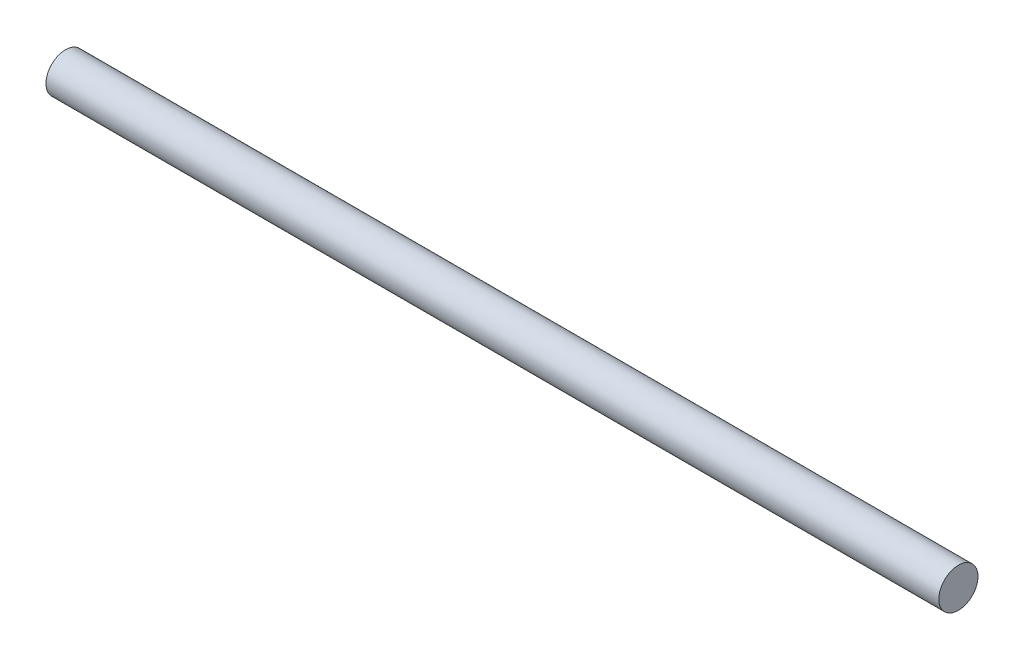
ISO-10303-21;
HEADER;
FILE_DESCRIPTION(('STEP AP214'),'2;1');
FILE_NAME('part.step','',(''),(''),'','','');
FILE_SCHEMA(('AUTOMOTIVE_DESIGN { 1 0 10303 214 1 1 1 1 }'));
ENDSEC;
DATA;
#1=APPLICATION_CONTEXT('core data for automotive mechanical design processes');
#2=APPLICATION_PROTOCOL_DEFINITION('international standard','automotive_design',2000,#1);
#3=PRODUCT_CONTEXT('',#1,'mechanical');
#4=PRODUCT('Part','Part','',(#3));
#5=PRODUCT_RELATED_PRODUCT_CATEGORY('part','',(#4));
#6=PRODUCT_DEFINITION_FORMATION('','',#4);
#7=PRODUCT_DEFINITION_CONTEXT('part definition',#1,'design');
#8=PRODUCT_DEFINITION('design','',#6,#7);
#9=PRODUCT_DEFINITION_SHAPE('','',#8);
#10=(LENGTH_UNIT() NAMED_UNIT(*) SI_UNIT(.MILLI.,.METRE.));
#11=(NAMED_UNIT(*) PLANE_ANGLE_UNIT() SI_UNIT($,.RADIAN.));
#12=(NAMED_UNIT(*) SI_UNIT($,.STERADIAN.) SOLID_ANGLE_UNIT());
#13=UNCERTAINTY_MEASURE_WITH_UNIT(LENGTH_MEASURE(1.E-05),#10,'distance_accuracy_value','');
#14=(GEOMETRIC_REPRESENTATION_CONTEXT(3) GLOBAL_UNCERTAINTY_ASSIGNED_CONTEXT((#13)) GLOBAL_UNIT_ASSIGNED_CONTEXT((#10,
#11,#12)) REPRESENTATION_CONTEXT('',''));
#15=CARTESIAN_POINT('',(0.,0.,0.));
#16=DIRECTION('',(0.,0.,1.));
#17=DIRECTION('',(1.,0.,0.));
#18=AXIS2_PLACEMENT_3D('',#15,#16,#17);
#19=CARTESIAN_POINT('',(90.4875,0.,0.));
#20=DIRECTION('',(-1.,0.,0.));
#21=DIRECTION('',(0.,0.,1.));
#22=AXIS2_PLACEMENT_3D('',#19,#20,#21);
#23=CYLINDRICAL_SURFACE('',#22,3.96875);
#24=CARTESIAN_POINT('',(90.4875,0.,0.));
#25=DIRECTION('',(1.,0.,0.));
#26=DIRECTION('',(0.,0.,-1.));
#27=AXIS2_PLACEMENT_3D('',#24,#25,#26);
#28=CIRCLE('',#27,3.96875);
#29=CARTESIAN_POINT('',(90.4875,0.,-3.96875));
#30=VERTEX_POINT('',#29);
#31=EDGE_CURVE('E10',#30,#30,#28,.T.);
#32=ORIENTED_EDGE('',*,*,#31,.F.);
#33=EDGE_LOOP('',(#32));
#34=FACE_BOUND('',#33,.T.);
#35=CARTESIAN_POINT('',(-90.4875,0.,0.));
#36=DIRECTION('',(1.,0.,0.));
#37=DIRECTION('',(0.,0.,-1.));
#38=AXIS2_PLACEMENT_3D('',#35,#36,#37);
#39=CIRCLE('',#38,3.96875);
#40=CARTESIAN_POINT('',(-90.4875,0.,-3.96875));
#41=VERTEX_POINT('',#40);
#42=EDGE_CURVE('E34',#41,#41,#39,.T.);
#43=ORIENTED_EDGE('',*,*,#42,.T.);
#44=EDGE_LOOP('',(#43));
#45=FACE_BOUND('',#44,.T.);
#46=ADVANCED_FACE('F31',(#34,#45),#23,.T.);
#47=CARTESIAN_POINT('',(90.4875,0.,0.));
#48=DIRECTION('',(1.,0.,0.));
#49=DIRECTION('',(0.,0.,-1.));
#50=AXIS2_PLACEMENT_3D('',#47,#48,#49);
#51=PLANE('',#50);
#52=ORIENTED_EDGE('',*,*,#31,.T.);
#53=EDGE_LOOP('',(#52));
#54=FACE_BOUND('',#53,.T.);
#55=ADVANCED_FACE('F46',(#54),#51,.T.);
#56=CARTESIAN_POINT('',(-90.4875,0.,0.));
#57=DIRECTION('',(1.,0.,0.));
#58=DIRECTION('',(0.,0.,-1.));
#59=AXIS2_PLACEMENT_3D('',#56,#57,#58);
#60=PLANE('',#59);
#61=ORIENTED_EDGE('',*,*,#42,.F.);
#62=EDGE_LOOP('',(#61));
#63=FACE_BOUND('',#62,.T.);
#64=ADVANCED_FACE('F44',(#63),#60,.F.);
#65=CLOSED_SHELL('',(#46,#55,#64));
#66=MANIFOLD_SOLID_BREP('B2',#65);
#67=ADVANCED_BREP_SHAPE_REPRESENTATION('',(#18,#66),#14);
#68=SHAPE_DEFINITION_REPRESENTATION(#9,#67);
ENDSEC;
END-ISO-10303-21;
